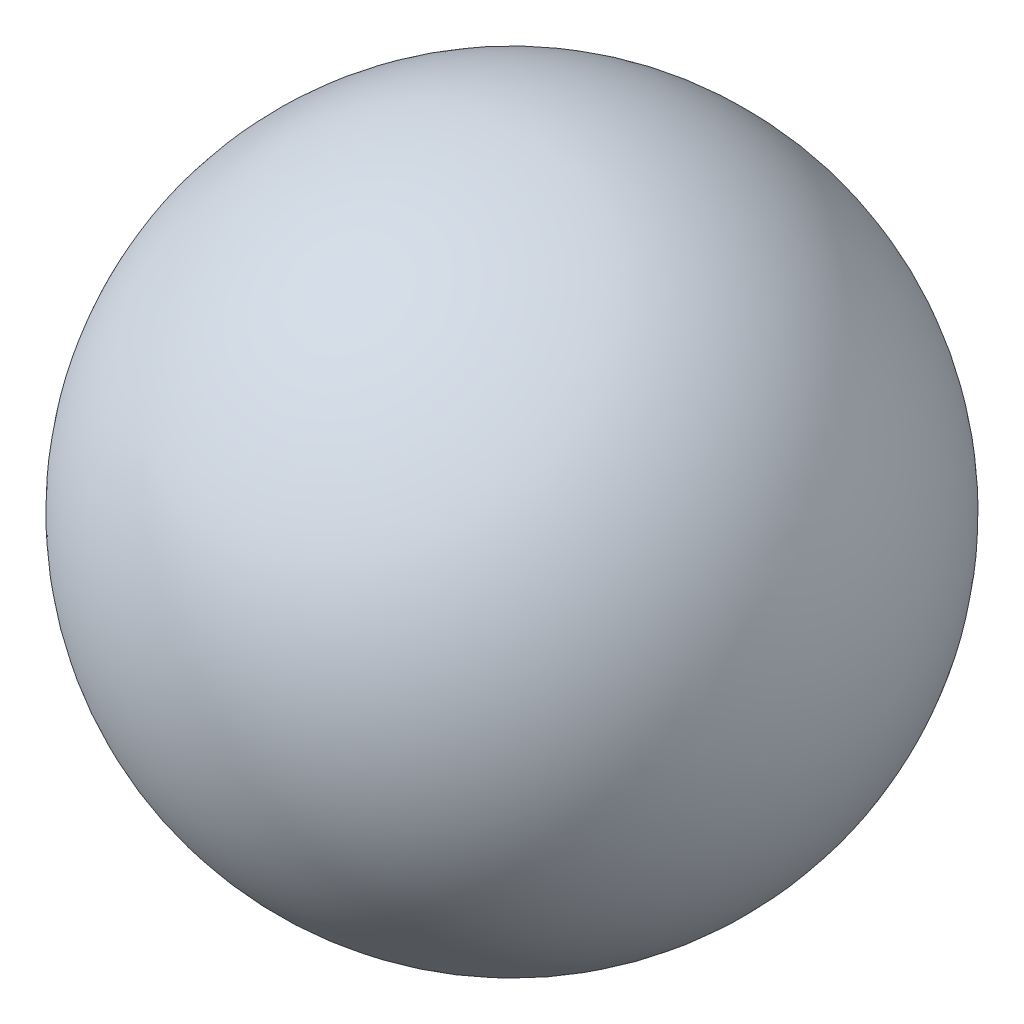
ISO-10303-21;
HEADER;
FILE_DESCRIPTION(('STEP AP214'),'2;1');
FILE_NAME('part.step','',(''),(''),'','','');
FILE_SCHEMA(('AUTOMOTIVE_DESIGN { 1 0 10303 214 1 1 1 1 }'));
ENDSEC;
DATA;
#1=APPLICATION_CONTEXT('core data for automotive mechanical design processes');
#2=APPLICATION_PROTOCOL_DEFINITION('international standard','automotive_design',2000,#1);
#3=PRODUCT_CONTEXT('',#1,'mechanical');
#4=PRODUCT('Part','Part','',(#3));
#5=PRODUCT_RELATED_PRODUCT_CATEGORY('part','',(#4));
#6=PRODUCT_DEFINITION_FORMATION('','',#4);
#7=PRODUCT_DEFINITION_CONTEXT('part definition',#1,'design');
#8=PRODUCT_DEFINITION('design','',#6,#7);
#9=PRODUCT_DEFINITION_SHAPE('','',#8);
#10=(LENGTH_UNIT() NAMED_UNIT(*) SI_UNIT(.MILLI.,.METRE.));
#11=(NAMED_UNIT(*) PLANE_ANGLE_UNIT() SI_UNIT($,.RADIAN.));
#12=(NAMED_UNIT(*) SI_UNIT($,.STERADIAN.) SOLID_ANGLE_UNIT());
#13=UNCERTAINTY_MEASURE_WITH_UNIT(LENGTH_MEASURE(1.E-05),#10,'distance_accuracy_value','');
#14=(GEOMETRIC_REPRESENTATION_CONTEXT(3) GLOBAL_UNCERTAINTY_ASSIGNED_CONTEXT((#13)) GLOBAL_UNIT_ASSIGNED_CONTEXT((#10,
#11,#12)) REPRESENTATION_CONTEXT('',''));
#15=CARTESIAN_POINT('',(0.,0.,0.));
#16=DIRECTION('',(0.,0.,1.));
#17=DIRECTION('',(1.,0.,0.));
#18=AXIS2_PLACEMENT_3D('',#15,#16,#17);
#19=CARTESIAN_POINT('',(0.,0.,0.));
#20=DIRECTION('',(-1.,0.,0.));
#21=DIRECTION('',(0.,1.,0.));
#22=AXIS2_PLACEMENT_3D('',#19,#20,#21);
#23=SPHERICAL_SURFACE('',#22,1.651);
#24=CARTESIAN_POINT('',(-1.651,0.,0.));
#25=VERTEX_POINT('',#24);
#26=VERTEX_LOOP('',#25);
#27=FACE_BOUND('',#26,.T.);
#28=ADVANCED_FACE('F33',(#27),#23,.T.);
#29=CLOSED_SHELL('',(#28));
#30=MANIFOLD_SOLID_BREP('B2',#29);
#31=ADVANCED_BREP_SHAPE_REPRESENTATION('',(#18,#30),#14);
#32=SHAPE_DEFINITION_REPRESENTATION(#9,#31);
ENDSEC;
END-ISO-10303-21;
